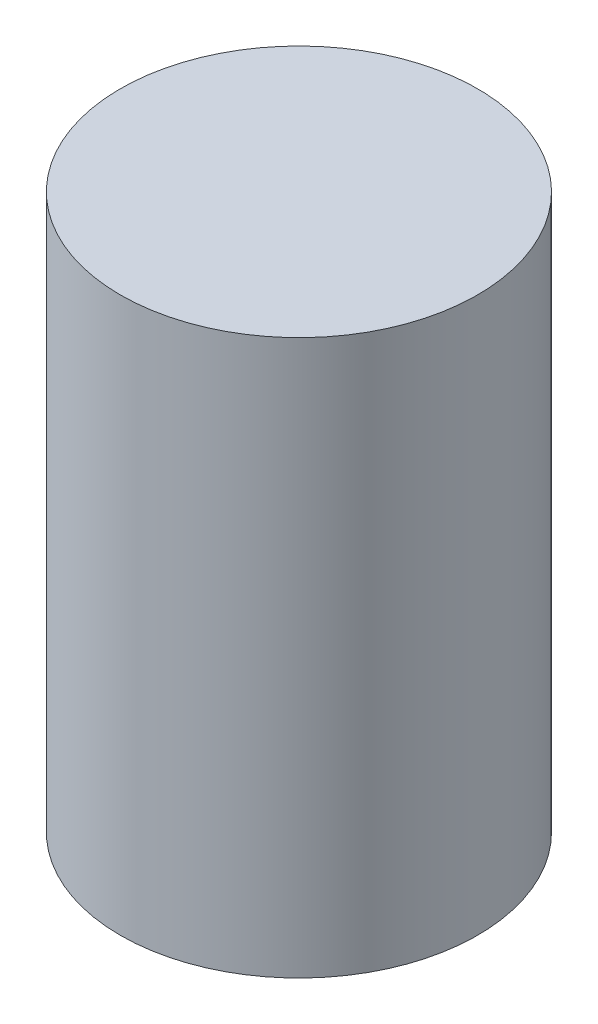
ISO-10303-21;
HEADER;
FILE_DESCRIPTION(('STEP AP214'),'2;1');
FILE_NAME('part.step','',(''),(''),'','','');
FILE_SCHEMA(('AUTOMOTIVE_DESIGN { 1 0 10303 214 1 1 1 1 }'));
ENDSEC;
DATA;
#1=APPLICATION_CONTEXT('core data for automotive mechanical design processes');
#2=APPLICATION_PROTOCOL_DEFINITION('international standard','automotive_design',2000,#1);
#3=PRODUCT_CONTEXT('',#1,'mechanical');
#4=PRODUCT('Part','Part','',(#3));
#5=PRODUCT_RELATED_PRODUCT_CATEGORY('part','',(#4));
#6=PRODUCT_DEFINITION_FORMATION('','',#4);
#7=PRODUCT_DEFINITION_CONTEXT('part definition',#1,'design');
#8=PRODUCT_DEFINITION('design','',#6,#7);
#9=PRODUCT_DEFINITION_SHAPE('','',#8);
#10=(LENGTH_UNIT() NAMED_UNIT(*) SI_UNIT(.MILLI.,.METRE.));
#11=(NAMED_UNIT(*) PLANE_ANGLE_UNIT() SI_UNIT($,.RADIAN.));
#12=(NAMED_UNIT(*) SI_UNIT($,.STERADIAN.) SOLID_ANGLE_UNIT());
#13=UNCERTAINTY_MEASURE_WITH_UNIT(LENGTH_MEASURE(1.E-05),#10,'distance_accuracy_value','');
#14=(GEOMETRIC_REPRESENTATION_CONTEXT(3) GLOBAL_UNCERTAINTY_ASSIGNED_CONTEXT((#13)) GLOBAL_UNIT_ASSIGNED_CONTEXT((#10,
#11,#12)) REPRESENTATION_CONTEXT('',''));
#15=CARTESIAN_POINT('',(0.,0.,0.));
#16=DIRECTION('',(0.,0.,1.));
#17=DIRECTION('',(1.,0.,0.));
#18=AXIS2_PLACEMENT_3D('',#15,#16,#17);
#19=CARTESIAN_POINT('',(0.,89.916,0.));
#20=DIRECTION('',(0.,-1.,0.));
#21=DIRECTION('',(0.,0.,-1.));
#22=AXIS2_PLACEMENT_3D('',#19,#20,#21);
#23=CYLINDRICAL_SURFACE('',#22,28.956);
#24=CARTESIAN_POINT('',(0.,89.916,0.));
#25=DIRECTION('',(0.,1.,0.));
#26=DIRECTION('',(0.,0.,1.));
#27=AXIS2_PLACEMENT_3D('',#24,#25,#26);
#28=CIRCLE('',#27,28.956);
#29=CARTESIAN_POINT('',(0.,89.916,28.956));
#30=VERTEX_POINT('',#29);
#31=EDGE_CURVE('E10',#30,#30,#28,.T.);
#32=ORIENTED_EDGE('',*,*,#31,.F.);
#33=EDGE_LOOP('',(#32));
#34=FACE_BOUND('',#33,.T.);
#35=CARTESIAN_POINT('',(0.,0.,0.));
#36=DIRECTION('',(0.,1.,0.));
#37=DIRECTION('',(0.,0.,1.));
#38=AXIS2_PLACEMENT_3D('',#35,#36,#37);
#39=CIRCLE('',#38,28.956);
#40=CARTESIAN_POINT('',(0.,0.,28.956));
#41=VERTEX_POINT('',#40);
#42=EDGE_CURVE('E33',#41,#41,#39,.T.);
#43=ORIENTED_EDGE('',*,*,#42,.T.);
#44=EDGE_LOOP('',(#43));
#45=FACE_BOUND('',#44,.T.);
#46=ADVANCED_FACE('F30',(#34,#45),#23,.T.);
#47=CARTESIAN_POINT('',(0.,89.916,0.));
#48=DIRECTION('',(0.,1.,0.));
#49=DIRECTION('',(0.,0.,1.));
#50=AXIS2_PLACEMENT_3D('',#47,#48,#49);
#51=PLANE('',#50);
#52=ORIENTED_EDGE('',*,*,#31,.T.);
#53=EDGE_LOOP('',(#52));
#54=FACE_BOUND('',#53,.T.);
#55=ADVANCED_FACE('F45',(#54),#51,.T.);
#56=CARTESIAN_POINT('',(0.,0.,0.));
#57=DIRECTION('',(0.,1.,0.));
#58=DIRECTION('',(0.,0.,1.));
#59=AXIS2_PLACEMENT_3D('',#56,#57,#58);
#60=PLANE('',#59);
#61=ORIENTED_EDGE('',*,*,#42,.F.);
#62=EDGE_LOOP('',(#61));
#63=FACE_BOUND('',#62,.T.);
#64=ADVANCED_FACE('F43',(#63),#60,.F.);
#65=CLOSED_SHELL('',(#46,#55,#64));
#66=MANIFOLD_SOLID_BREP('B2',#65);
#67=ADVANCED_BREP_SHAPE_REPRESENTATION('',(#18,#66),#14);
#68=SHAPE_DEFINITION_REPRESENTATION(#9,#67);
ENDSEC;
END-ISO-10303-21;
